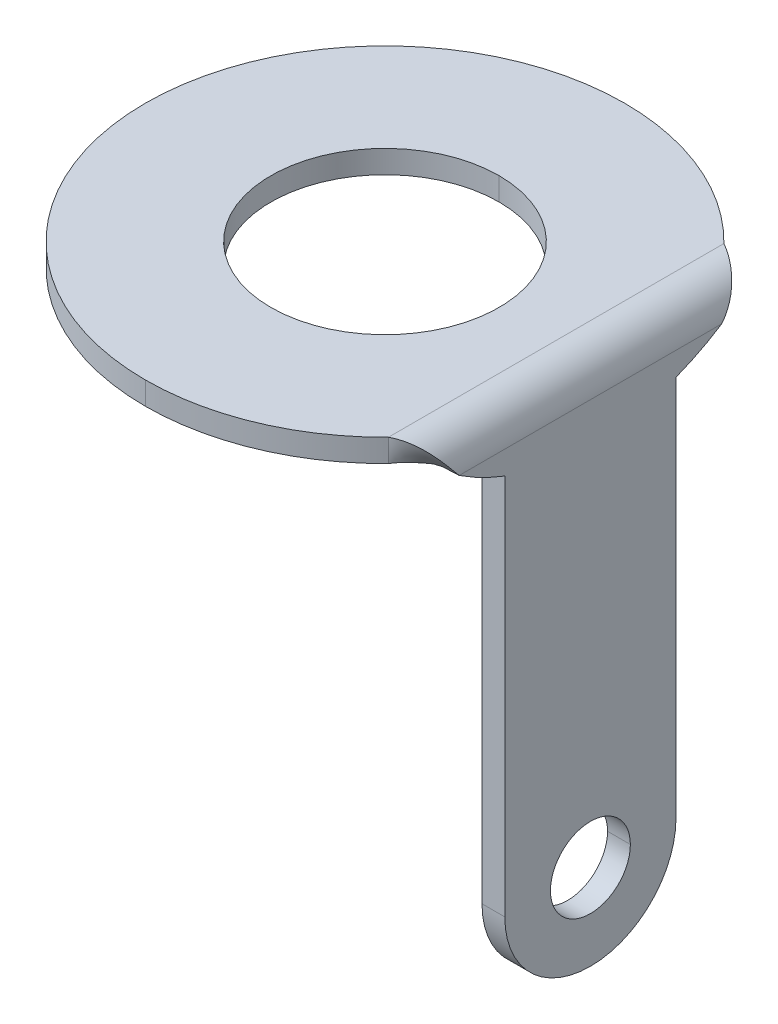
ISO-10303-21;
HEADER;
FILE_DESCRIPTION(('STEP AP214'),'2;1');
FILE_NAME('part.step','',(''),(''),'','','');
FILE_SCHEMA(('AUTOMOTIVE_DESIGN { 1 0 10303 214 1 1 1 1 }'));
ENDSEC;
DATA;
#1=APPLICATION_CONTEXT('core data for automotive mechanical design processes');
#2=APPLICATION_PROTOCOL_DEFINITION('international standard','automotive_design',2000,#1);
#3=PRODUCT_CONTEXT('',#1,'mechanical');
#4=PRODUCT('Part','Part','',(#3));
#5=PRODUCT_RELATED_PRODUCT_CATEGORY('part','',(#4));
#6=PRODUCT_DEFINITION_FORMATION('','',#4);
#7=PRODUCT_DEFINITION_CONTEXT('part definition',#1,'design');
#8=PRODUCT_DEFINITION('design','',#6,#7);
#9=PRODUCT_DEFINITION_SHAPE('','',#8);
#10=(LENGTH_UNIT() NAMED_UNIT(*) SI_UNIT(.MILLI.,.METRE.));
#11=(NAMED_UNIT(*) PLANE_ANGLE_UNIT() SI_UNIT($,.RADIAN.));
#12=(NAMED_UNIT(*) SI_UNIT($,.STERADIAN.) SOLID_ANGLE_UNIT());
#13=UNCERTAINTY_MEASURE_WITH_UNIT(LENGTH_MEASURE(1.E-05),#10,'distance_accuracy_value','');
#14=(GEOMETRIC_REPRESENTATION_CONTEXT(3) GLOBAL_UNCERTAINTY_ASSIGNED_CONTEXT((#13)) GLOBAL_UNIT_ASSIGNED_CONTEXT((#10,
#11,#12)) REPRESENTATION_CONTEXT('',''));
#15=CARTESIAN_POINT('',(0.,0.,0.));
#16=DIRECTION('',(0.,0.,1.));
#17=DIRECTION('',(1.,0.,0.));
#18=AXIS2_PLACEMENT_3D('',#15,#16,#17);
#19=CARTESIAN_POINT('',(-0.4,-9.2,5.));
#20=DIRECTION('',(1.,0.,0.));
#21=DIRECTION('',(0.,1.,0.));
#22=AXIS2_PLACEMENT_3D('',#19,#20,#21);
#23=PLANE('',#22);
#24=CARTESIAN_POINT('',(-0.4,-7.7,0.));
#25=DIRECTION('',(1.,0.,0.));
#26=DIRECTION('',(0.,0.,1.));
#27=AXIS2_PLACEMENT_3D('',#24,#25,#26);
#28=CIRCLE('',#27,0.7);
#29=CARTESIAN_POINT('',(-0.4,-7.7,0.7));
#30=VERTEX_POINT('',#29);
#31=CARTESIAN_POINT('',(-0.4,-7.7,-0.7));
#32=VERTEX_POINT('',#31);
#33=EDGE_CURVE('E418',#30,#32,#28,.T.);
#34=ORIENTED_EDGE('',*,*,#33,.T.);
#35=CARTESIAN_POINT('',(-0.4,-7.7,0.));
#36=DIRECTION('',(1.,0.,0.));
#37=DIRECTION('',(0.,0.,1.));
#38=AXIS2_PLACEMENT_3D('',#35,#36,#37);
#39=CIRCLE('',#38,0.7);
#40=EDGE_CURVE('E400',#32,#30,#39,.T.);
#41=ORIENTED_EDGE('',*,*,#40,.T.);
#42=EDGE_LOOP('',(#34,#41));
#43=FACE_BOUND('',#42,.T.);
#44=CARTESIAN_POINT('',(-0.4,-7.7,0.));
#45=DIRECTION('',(1.,0.,0.));
#46=DIRECTION('',(0.,0.,1.));
#47=AXIS2_PLACEMENT_3D('',#44,#45,#46);
#48=CIRCLE('',#47,1.5);
#49=CARTESIAN_POINT('',(-0.4,-7.7,1.5));
#50=VERTEX_POINT('',#49);
#51=CARTESIAN_POINT('',(-0.4,-7.7,-1.5));
#52=VERTEX_POINT('',#51);
#53=EDGE_CURVE('E408',#50,#52,#48,.T.);
#54=ORIENTED_EDGE('',*,*,#53,.F.);
#55=DIRECTION('',(0.,-1.,0.));
#56=VECTOR('',#55,1.);
#57=CARTESIAN_POINT('',(-0.4,-4.354424891914,1.5));
#58=LINE('',#57,#56);
#59=CARTESIAN_POINT('',(-0.4,-1.00884978382783,1.5));
#60=VERTEX_POINT('',#59);
#61=EDGE_CURVE('E28',#60,#50,#58,.T.);
#62=ORIENTED_EDGE('',*,*,#61,.F.);
#63=CARTESIAN_POINT('',(-0.4,2.914159265359,1.412203687323E-13));
#64=DIRECTION('',(1.,0.,0.));
#65=DIRECTION('',(0.,0.,1.));
#66=AXIS2_PLACEMENT_3D('',#63,#64,#65);
#67=CIRCLE('',#66,4.2);
#68=CARTESIAN_POINT('',(-0.4,-0.599999999999978,2.30014883381305));
#69=VERTEX_POINT('',#68);
#70=EDGE_CURVE('E11',#69,#60,#67,.T.);
#71=ORIENTED_EDGE('',*,*,#70,.F.);
#72=DIRECTION('',(0.,0.,-1.));
#73=VECTOR('',#72,1.);
#74=CARTESIAN_POINT('',(-0.4,-0.6,5.));
#75=LINE('',#74,#73);
#76=CARTESIAN_POINT('',(-0.4,-0.599999999999952,-2.30014883381284));
#77=VERTEX_POINT('',#76);
#78=EDGE_CURVE('E365',#69,#77,#75,.T.);
#79=ORIENTED_EDGE('',*,*,#78,.T.);
#80=CARTESIAN_POINT('',(-0.4,2.914159265359,-1.465494392505E-13));
#81=DIRECTION('',(1.,0.,0.));
#82=DIRECTION('',(0.,0.,1.));
#83=AXIS2_PLACEMENT_3D('',#80,#81,#82);
#84=CIRCLE('',#83,4.2);
#85=CARTESIAN_POINT('',(-0.4,-1.00884978382768,-1.49999999999994));
#86=VERTEX_POINT('',#85);
#87=EDGE_CURVE('E323',#86,#77,#84,.T.);
#88=ORIENTED_EDGE('',*,*,#87,.F.);
#89=DIRECTION('',(0.,1.,0.));
#90=VECTOR('',#89,1.);
#91=CARTESIAN_POINT('',(-0.4,-4.354424891914,-1.5));
#92=LINE('',#91,#90);
#93=EDGE_CURVE('E180',#52,#86,#92,.T.);
#94=ORIENTED_EDGE('',*,*,#93,.F.);
#95=EDGE_LOOP('',(#54,#62,#71,#79,#88,#94));
#96=FACE_BOUND('',#95,.T.);
#97=ADVANCED_FACE('F17',(#43,#96),#23,.F.);
#98=CARTESIAN_POINT('',(-0.2,2.914159265359,1.412203687323E-13));
#99=DIRECTION('',(-1.,0.,0.));
#100=DIRECTION('',(0.,0.,1.));
#101=AXIS2_PLACEMENT_3D('',#98,#99,#100);
#102=CYLINDRICAL_SURFACE('',#101,4.2);
#103=DIRECTION('',(-1.,0.,0.));
#104=VECTOR('',#103,1.);
#105=CARTESIAN_POINT('',(-0.2,-1.008849783828,1.5));
#106=LINE('',#105,#104);
#107=CARTESIAN_POINT('',(0.,-1.00884978382783,1.5));
#108=VERTEX_POINT('',#107);
#109=EDGE_CURVE('E405',#108,#60,#106,.T.);
#110=ORIENTED_EDGE('',*,*,#109,.F.);
#111=CARTESIAN_POINT('',(0.,2.914159265359,1.412203687323E-13));
#112=DIRECTION('',(1.,0.,0.));
#113=DIRECTION('',(0.,0.,1.));
#114=AXIS2_PLACEMENT_3D('',#111,#112,#113);
#115=CIRCLE('',#114,4.2);
#116=CARTESIAN_POINT('',(0.,-0.600000000000009,2.30014883381305));
#117=VERTEX_POINT('',#116);
#118=EDGE_CURVE('E245',#117,#108,#115,.T.);
#119=ORIENTED_EDGE('',*,*,#118,.F.);
#120=DIRECTION('',(1.,-1.56792025836786E-13,0.));
#121=VECTOR('',#120,1.);
#122=CARTESIAN_POINT('',(-0.199961399023881,-0.599999999999987,2.30014883381292));
#123=LINE('',#122,#121);
#124=EDGE_CURVE('E372',#69,#117,#123,.T.);
#125=ORIENTED_EDGE('',*,*,#124,.F.);
#126=ORIENTED_EDGE('',*,*,#70,.T.);
#127=EDGE_LOOP('',(#110,#119,#125,#126));
#128=FACE_BOUND('',#127,.T.);
#129=ADVANCED_FACE('F584',(#128),#102,.T.);
#130=CARTESIAN_POINT('',(-0.2,-4.354424891914,1.5));
#131=DIRECTION('',(0.,0.,1.));
#132=DIRECTION('',(1.,0.,0.));
#133=AXIS2_PLACEMENT_3D('',#130,#131,#132);
#134=PLANE('',#133);
#135=DIRECTION('',(-1.,0.,0.));
#136=VECTOR('',#135,1.);
#137=CARTESIAN_POINT('',(-0.2,-7.7,1.5));
#138=LINE('',#137,#136);
#139=CARTESIAN_POINT('',(0.,-7.7,1.5));
#140=VERTEX_POINT('',#139);
#141=EDGE_CURVE('E183',#140,#50,#138,.T.);
#142=ORIENTED_EDGE('',*,*,#141,.F.);
#143=DIRECTION('',(0.,-1.,0.));
#144=VECTOR('',#143,1.);
#145=CARTESIAN_POINT('',(0.,-9.2,1.5));
#146=LINE('',#145,#144);
#147=EDGE_CURVE('E249',#108,#140,#146,.T.);
#148=ORIENTED_EDGE('',*,*,#147,.F.);
#149=ORIENTED_EDGE('',*,*,#109,.T.);
#150=ORIENTED_EDGE('',*,*,#61,.T.);
#151=EDGE_LOOP('',(#142,#148,#149,#150));
#152=FACE_BOUND('',#151,.T.);
#153=ADVANCED_FACE('F444',(#152),#134,.T.);
#154=CARTESIAN_POINT('',(-0.2,-7.7,0.));
#155=DIRECTION('',(-1.,0.,0.));
#156=DIRECTION('',(0.,0.,1.));
#157=AXIS2_PLACEMENT_3D('',#154,#155,#156);
#158=CYLINDRICAL_SURFACE('',#157,1.5);
#159=DIRECTION('',(-1.,0.,0.));
#160=VECTOR('',#159,1.);
#161=CARTESIAN_POINT('',(-0.2,-7.7,-1.5));
#162=LINE('',#161,#160);
#163=CARTESIAN_POINT('',(0.,-7.7,-1.5));
#164=VERTEX_POINT('',#163);
#165=EDGE_CURVE('E184',#164,#52,#162,.T.);
#166=ORIENTED_EDGE('',*,*,#165,.F.);
#167=CARTESIAN_POINT('',(0.,-7.7,0.));
#168=DIRECTION('',(1.,0.,0.));
#169=DIRECTION('',(0.,0.,1.));
#170=AXIS2_PLACEMENT_3D('',#167,#168,#169);
#171=CIRCLE('',#170,1.5);
#172=EDGE_CURVE('E422',#140,#164,#171,.T.);
#173=ORIENTED_EDGE('',*,*,#172,.F.);
#174=ORIENTED_EDGE('',*,*,#141,.T.);
#175=ORIENTED_EDGE('',*,*,#53,.T.);
#176=EDGE_LOOP('',(#166,#173,#174,#175));
#177=FACE_BOUND('',#176,.T.);
#178=ADVANCED_FACE('F450',(#177),#158,.T.);
#179=CARTESIAN_POINT('',(-0.2,-4.354424891914,-1.5));
#180=DIRECTION('',(0.,0.,-1.));
#181=DIRECTION('',(0.,-1.,0.));
#182=AXIS2_PLACEMENT_3D('',#179,#180,#181);
#183=PLANE('',#182);
#184=DIRECTION('',(-1.,0.,0.));
#185=VECTOR('',#184,1.);
#186=CARTESIAN_POINT('',(-0.2,-1.00884978382771,-1.49999999999989));
#187=LINE('',#186,#185);
#188=CARTESIAN_POINT('',(0.,-1.00884978382768,-1.49999999999994));
#189=VERTEX_POINT('',#188);
#190=EDGE_CURVE('E369',#189,#86,#187,.T.);
#191=ORIENTED_EDGE('',*,*,#190,.F.);
#192=DIRECTION('',(0.,1.,0.));
#193=VECTOR('',#192,1.);
#194=CARTESIAN_POINT('',(0.,-9.2,-1.5));
#195=LINE('',#194,#193);
#196=EDGE_CURVE('E398',#164,#189,#195,.T.);
#197=ORIENTED_EDGE('',*,*,#196,.F.);
#198=ORIENTED_EDGE('',*,*,#165,.T.);
#199=ORIENTED_EDGE('',*,*,#93,.T.);
#200=EDGE_LOOP('',(#191,#197,#198,#199));
#201=FACE_BOUND('',#200,.T.);
#202=ADVANCED_FACE('F574',(#201),#183,.T.);
#203=CARTESIAN_POINT('',(-0.2,-7.7,0.));
#204=DIRECTION('',(-1.,0.,0.));
#205=DIRECTION('',(0.,0.,1.));
#206=AXIS2_PLACEMENT_3D('',#203,#204,#205);
#207=CYLINDRICAL_SURFACE('',#206,0.7);
#208=DIRECTION('',(-1.,0.,0.));
#209=VECTOR('',#208,1.);
#210=CARTESIAN_POINT('',(-0.2,-7.7,-0.7));
#211=LINE('',#210,#209);
#212=CARTESIAN_POINT('',(0.,-7.7,-0.7));
#213=VERTEX_POINT('',#212);
#214=EDGE_CURVE('E412',#213,#32,#211,.T.);
#215=ORIENTED_EDGE('',*,*,#214,.F.);
#216=CARTESIAN_POINT('',(0.,-7.7,0.));
#217=DIRECTION('',(-1.,0.,0.));
#218=DIRECTION('',(0.,0.,1.));
#219=AXIS2_PLACEMENT_3D('',#216,#217,#218);
#220=CIRCLE('',#219,0.7);
#221=CARTESIAN_POINT('',(0.,-7.7,0.7));
#222=VERTEX_POINT('',#221);
#223=EDGE_CURVE('E166',#222,#213,#220,.T.);
#224=ORIENTED_EDGE('',*,*,#223,.F.);
#225=DIRECTION('',(-1.,0.,0.));
#226=VECTOR('',#225,1.);
#227=CARTESIAN_POINT('',(-0.2,-7.7,0.7));
#228=LINE('',#227,#226);
#229=EDGE_CURVE('E235',#222,#30,#228,.T.);
#230=ORIENTED_EDGE('',*,*,#229,.T.);
#231=ORIENTED_EDGE('',*,*,#40,.F.);
#232=EDGE_LOOP('',(#215,#224,#230,#231));
#233=FACE_BOUND('',#232,.T.);
#234=ADVANCED_FACE('F578',(#233),#207,.F.);
#235=CARTESIAN_POINT('',(-0.2,2.914159265359,-1.465494392505E-13));
#236=DIRECTION('',(-1.,0.,0.));
#237=DIRECTION('',(0.,0.,1.));
#238=AXIS2_PLACEMENT_3D('',#235,#236,#237);
#239=CYLINDRICAL_SURFACE('',#238,4.2);
#240=DIRECTION('',(-1.,-2.94623155525761E-13,0.));
#241=VECTOR('',#240,1.);
#242=CARTESIAN_POINT('',(-0.199961399023923,-0.599999999999845,-2.3001488338125));
#243=LINE('',#242,#241);
#244=CARTESIAN_POINT('',(0.,-0.599999999999893,-2.30014883381284));
#245=VERTEX_POINT('',#244);
#246=EDGE_CURVE('E348',#245,#77,#243,.T.);
#247=ORIENTED_EDGE('',*,*,#246,.F.);
#248=CARTESIAN_POINT('',(0.,2.914159265359,-1.465494392505E-13));
#249=DIRECTION('',(1.,0.,0.));
#250=DIRECTION('',(0.,0.,1.));
#251=AXIS2_PLACEMENT_3D('',#248,#249,#250);
#252=CIRCLE('',#251,4.2);
#253=EDGE_CURVE('E250',#189,#245,#252,.T.);
#254=ORIENTED_EDGE('',*,*,#253,.F.);
#255=ORIENTED_EDGE('',*,*,#190,.T.);
#256=ORIENTED_EDGE('',*,*,#87,.T.);
#257=EDGE_LOOP('',(#247,#254,#255,#256));
#258=FACE_BOUND('',#257,.T.);
#259=ADVANCED_FACE('F333',(#258),#239,.T.);
#260=CARTESIAN_POINT('',(-0.6,-0.6,5.));
#261=DIRECTION('',(0.,0.,1.));
#262=DIRECTION('',(1.,0.,0.));
#263=AXIS2_PLACEMENT_3D('',#260,#261,#262);
#264=CYLINDRICAL_SURFACE('',#263,0.2);
#265=CARTESIAN_POINT('',(-0.605590475356138,-0.400079382313339,2.94869621659));
#266=CARTESIAN_POINT('',(-0.603724110918284,-0.400026330773651,2.945598116979));
#267=CARTESIAN_POINT('',(-0.572528574579034,-0.399585592102016,2.893660994816));
#268=CARTESIAN_POINT('',(-0.51378413205663,-0.413044349412892,2.790317247872));
#269=CARTESIAN_POINT('',(-0.447538614646796,-0.462621701692243,2.633401409728));
#270=CARTESIAN_POINT('',(-0.40796176854271,-0.52945023933194,2.470187557845));
#271=CARTESIAN_POINT('',(-0.399742717392321,-0.57862683406739,2.353796463909));
#272=CARTESIAN_POINT('',(-0.400016628049382,-0.602957869380745,2.292739618266));
#273=CARTESIAN_POINT('',(-0.400049715475822,-0.604430674436012,2.289029281986));
#274=(BOUNDED_CURVE() B_SPLINE_CURVE(3,(#265,#266,#267,#268,#269,#270,#271,#272,#273),
.UNSPECIFIED.,.F.,.F.) B_SPLINE_CURVE_WITH_KNOTS((4,1,1,1,1,1,4),(-0.01615737799204,
-0.000272802806039807,0.24972719719396,0.49972719719396,0.74972719719396,0.99972719719396,
1.015884575186),
.UNSPECIFIED.) CURVE() GEOMETRIC_REPRESENTATION_ITEM() RATIONAL_B_SPLINE_CURVE((1.,1.,1.,1.,1.,
1.,1.,1.,1.)) REPRESENTATION_ITEM(''));
#275=CARTESIAN_POINT('',(-0.600000000000134,-0.4,2.93938769133982));
#276=VERTEX_POINT('',#275);
#277=EDGE_CURVE('E190',#276,#69,#274,.T.);
#278=ORIENTED_EDGE('',*,*,#277,.F.);
#279=DIRECTION('',(0.,0.,-1.));
#280=VECTOR('',#279,1.);
#281=CARTESIAN_POINT('',(-0.6,-0.4,5.));
#282=LINE('',#281,#280);
#283=CARTESIAN_POINT('',(-0.6,-0.4,-2.93938769133991));
#284=VERTEX_POINT('',#283);
#285=EDGE_CURVE('E340',#276,#284,#282,.T.);
#286=ORIENTED_EDGE('',*,*,#285,.T.);
#287=CARTESIAN_POINT('',(-0.400049822774197,-0.604435447981233,-2.289017256271));
#288=CARTESIAN_POINT('',(-0.400016663997948,-0.60296106090554,-2.292731609366));
#289=CARTESIAN_POINT('',(-0.399742439429786,-0.578628497185309,-2.353792527643));
#290=CARTESIAN_POINT('',(-0.407961768542792,-0.529450239331833,-2.470187557845));
#291=CARTESIAN_POINT('',(-0.447538614646783,-0.46262170169213,-2.633401409727));
#292=CARTESIAN_POINT('',(-0.513784132056737,-0.413044349412789,-2.790317247872));
#293=CARTESIAN_POINT('',(-0.572525016895691,-0.399586407191761,-2.893654736108));
#294=CARTESIAN_POINT('',(-0.603716779607954,-0.400026227296697,-2.945585911118));
#295=CARTESIAN_POINT('',(-0.605579462653133,-0.400079069585649,-2.948677935782));
#296=(BOUNDED_CURVE() B_SPLINE_CURVE(3,(#287,#288,#289,#290,#291,#292,#293,#294,#295),
.UNSPECIFIED.,.F.,.F.) B_SPLINE_CURVE_WITH_KNOTS((4,1,1,1,1,1,4),(-0.0158533321630301,
0.000321501909970046,0.25032150190997,0.50032150190997,0.75032150190997,1.00032150190997,
1.016174834073),
.UNSPECIFIED.) CURVE() GEOMETRIC_REPRESENTATION_ITEM() RATIONAL_B_SPLINE_CURVE((1.,1.,1.,1.,1.,
1.,1.,1.,1.)) REPRESENTATION_ITEM(''));
#297=EDGE_CURVE('E318',#77,#284,#296,.T.);
#298=ORIENTED_EDGE('',*,*,#297,.F.);
#299=ORIENTED_EDGE('',*,*,#78,.F.);
#300=EDGE_LOOP('',(#278,#286,#298,#299));
#301=FACE_BOUND('',#300,.T.);
#302=ADVANCED_FACE('F209',(#301),#264,.F.);
#303=CARTESIAN_POINT('',(0.02288945550171,-0.6138025329323,2.289029281986));
#304=CARTESIAN_POINT('',(-0.1257440745466,-0.61050898032,2.289029281986));
#305=CARTESIAN_POINT('',(-0.274377604595,-0.6072154277077,2.289029281986));
#306=CARTESIAN_POINT('',(-0.4230111346434,-0.6039218750954,2.289029281986));
#307=CARTESIAN_POINT('',(0.02299253016889,-0.6092144187361,2.292739618266));
#308=CARTESIAN_POINT('',(-0.1256655954983,-0.6070156793418,2.292739618266));
#309=CARTESIAN_POINT('',(-0.2743237211655,-0.6048169399475,2.292739618266));
#310=CARTESIAN_POINT('',(-0.4229818468328,-0.6026182005533,2.292739618266));
#311=CARTESIAN_POINT('',(0.02384582257815,-0.5334178507332,2.353796463909));
#312=CARTESIAN_POINT('',(-0.1250159152418,-0.549305645584,2.353796463909));
#313=CARTESIAN_POINT('',(-0.2738776530618,-0.5651934404348,2.353796463909));
#314=CARTESIAN_POINT('',(-0.4227393908817,-0.5810812352856,2.353796463909));
#315=CARTESIAN_POINT('',(-0.001758343517437,-0.380221858084,2.470187557845));
#316=CARTESIAN_POINT('',(-0.1445104296855,-0.4326651941718,2.470187557845));
#317=CARTESIAN_POINT('',(-0.2872625158536,-0.4851085302597,2.470187557845));
#318=CARTESIAN_POINT('',(-0.4300146020217,-0.5375518663475,2.470187557845));
#319=CARTESIAN_POINT('',(-0.1250489913847,-0.1720361507146,2.633401409728));
#320=CARTESIAN_POINT('',(-0.2383815327963,-0.2741566427065,2.633401409728));
#321=CARTESIAN_POINT('',(-0.351714074208,-0.3762771346983,2.633401409728));
#322=CARTESIAN_POINT('',(-0.4650466156196,-0.4783976266902,2.633401409728));
#323=CARTESIAN_POINT('',(-0.3314184615108,-0.01759170948777,2.790317247872));
#324=CARTESIAN_POINT('',(-0.3955072365236,-0.1565656468111,2.790317247872));
#325=CARTESIAN_POINT('',(-0.4595960115363,-0.2955395841344,2.790317247872));
#326=CARTESIAN_POINT('',(-0.5236847865491,-0.4345135214578,2.790317247872));
#327=CARTESIAN_POINT('',(-0.5144204207408,0.02433530268457,2.893660994816));
#328=CARTESIAN_POINT('',(-0.5348413716062,-0.1246432346019,2.893660994816));
#329=CARTESIAN_POINT('',(-0.5552623224715,-0.2736217718884,2.893660994816));
#330=CARTESIAN_POINT('',(-0.5756832733369,-0.4226003091749,2.893660994816));
#331=CARTESIAN_POINT('',(-0.611601430964,0.02296230403213,2.945598116979));
#332=CARTESIAN_POINT('',(-0.6088331040601,-0.1256886090914,2.945598116979));
#333=CARTESIAN_POINT('',(-0.6060647771563,-0.2743395222149,2.945598116979));
#334=CARTESIAN_POINT('',(-0.6032964502524,-0.4229904353385,2.945598116979));
#335=CARTESIAN_POINT('',(-0.6174155698696,0.02279703672718,2.94869621659));
#336=CARTESIAN_POINT('',(-0.613259876424,-0.1258144404054,2.94869621659));
#337=CARTESIAN_POINT('',(-0.6091041829785,-0.274425917538,2.94869621659));
#338=CARTESIAN_POINT('',(-0.604948489533,-0.4230373946706,2.94869621659));
#339=(BOUNDED_SURFACE() B_SPLINE_SURFACE(3,3,((#303,#304,#305,#306),(#307,#308,#309,#310),(#311,
#312,#313,#314),(#315,#316,#317,#318),(#319,#320,#321,#322),(#323,#324,#325,#326),(#327,#328,
#329,#330),(#331,#332,#333,#334),(#335,#336,#337,#338)),.UNSPECIFIED.,.F.,.F.,
.F.) B_SPLINE_SURFACE_WITH_KNOTS((4,1,1,1,1,1,4),(4,4),(-0.01615737799204,0.,0.25,0.5,0.75,1.,
1.015884575186),(-0.05761082557077,1.05741782069),
.UNSPECIFIED.) GEOMETRIC_REPRESENTATION_ITEM() RATIONAL_B_SPLINE_SURFACE(((1.,1.,1.,1.),(1.,1.,
1.,1.),(1.,1.,1.,1.),(1.,1.,1.,1.),(1.,1.,1.,1.),(1.,1.,1.,1.),(1.,1.,1.,1.),(1.,1.,1.,1.),(1.,
1.,1.,1.))) REPRESENTATION_ITEM('') SURFACE());
#340=CARTESIAN_POINT('',(-0.000149146427385475,-0.613292023308108,2.289029281986));
#341=CARTESIAN_POINT('',(-4.98841481121614E-05,-0.608873608142187,2.292739618266));
#342=CARTESIAN_POINT('',(0.000771847822975634,-0.535880502202083,2.353796463909));
#343=CARTESIAN_POINT('',(-0.0238853056282402,-0.388350717995811,2.470187557845));
#344=CARTESIAN_POINT('',(-0.142615843940419,-0.187865105076647,2.633401409728));
#345=CARTESIAN_POINT('',(-0.341352396169845,-0.0391330482386593,2.790317247872));
#346=CARTESIAN_POINT('',(-0.517585723737025,0.00124322369400682,2.893660994816));
#347=CARTESIAN_POINT('',(-0.611172332754951,-7.8992320962728E-05,2.945598116979));
#348=CARTESIAN_POINT('',(-0.616771426068391,-0.000238146939920378,2.94869621659));
#349=(BOUNDED_CURVE() B_SPLINE_CURVE(3,(#340,#341,#342,#343,#344,#345,#346,#347,#348),
.UNSPECIFIED.,.F.,.F.) B_SPLINE_CURVE_WITH_KNOTS((4,1,1,1,1,1,4),(-0.01615737799204,0.,0.25,0.5,
0.75,1.,1.015884575186),
.UNSPECIFIED.) CURVE() GEOMETRIC_REPRESENTATION_ITEM() RATIONAL_B_SPLINE_CURVE((1.,1.,1.,1.,1.,
1.,1.,1.,1.)) REPRESENTATION_ITEM(''));
#350=CARTESIAN_POINT('',(-0.600000000000173,0.,2.93938769133971));
#351=VERTEX_POINT('',#350);
#352=EDGE_CURVE('E349',#351,#117,#349,.F.);
#353=DIRECTION('',(0.,1.,0.));
#354=VECTOR('',#353,1.);
#355=CARTESIAN_POINT('',(-0.600000000000093,-0.2,2.93938769133991));
#356=LINE('',#355,#354);
#357=EDGE_CURVE('E179',#276,#351,#356,.T.);
#358=ORIENTED_EDGE('',*,*,#124,.T.);
#359=ORIENTED_EDGE('',*,*,#352,.F.);
#360=ORIENTED_EDGE('',*,*,#357,.F.);
#361=ORIENTED_EDGE('',*,*,#277,.T.);
#362=EDGE_LOOP('',(#358,#359,#360,#361));
#363=FACE_BOUND('',#362,.T.);
#364=ADVANCED_FACE('F196',(#363),#339,.T.);
#365=CARTESIAN_POINT('',(0.,-9.2,5.));
#366=DIRECTION('',(1.,0.,0.));
#367=DIRECTION('',(0.,1.,0.));
#368=AXIS2_PLACEMENT_3D('',#365,#366,#367);
#369=PLANE('',#368);
#370=ORIENTED_EDGE('',*,*,#223,.T.);
#371=CARTESIAN_POINT('',(0.,-7.7,0.));
#372=DIRECTION('',(-1.,0.,0.));
#373=DIRECTION('',(0.,0.,1.));
#374=AXIS2_PLACEMENT_3D('',#371,#372,#373);
#375=CIRCLE('',#374,0.7);
#376=EDGE_CURVE('E174',#213,#222,#375,.T.);
#377=ORIENTED_EDGE('',*,*,#376,.T.);
#378=EDGE_LOOP('',(#370,#377));
#379=FACE_BOUND('',#378,.T.);
#380=ORIENTED_EDGE('',*,*,#172,.T.);
#381=ORIENTED_EDGE('',*,*,#196,.T.);
#382=ORIENTED_EDGE('',*,*,#253,.T.);
#383=DIRECTION('',(0.,0.,-1.));
#384=VECTOR('',#383,1.);
#385=CARTESIAN_POINT('',(0.,-0.6,5.));
#386=LINE('',#385,#384);
#387=EDGE_CURVE('E253',#117,#245,#386,.T.);
#388=ORIENTED_EDGE('',*,*,#387,.F.);
#389=ORIENTED_EDGE('',*,*,#118,.T.);
#390=ORIENTED_EDGE('',*,*,#147,.T.);
#391=EDGE_LOOP('',(#380,#381,#382,#388,#389,#390));
#392=FACE_BOUND('',#391,.T.);
#393=ADVANCED_FACE('F208',(#379,#392),#369,.T.);
#394=CARTESIAN_POINT('',(-0.6173812628588,0.02279801094301,-2.948677935782));
#395=CARTESIAN_POINT('',(-0.6132337557328,-0.1258136986564,-2.948677935782));
#396=CARTESIAN_POINT('',(-0.6090862486068,-0.2744254082558,-2.948677935782));
#397=CARTESIAN_POINT('',(-0.6049387414808,-0.4230371178552,-2.948677935782));
#398=CARTESIAN_POINT('',(-0.6115785923072,0.02296262638584,-2.945585911118));
#399=CARTESIAN_POINT('',(-0.6088157151507,-0.1256883636576,-2.945585911118));
#400=CARTESIAN_POINT('',(-0.6060528379943,-0.274339353701,-2.945585911118));
#401=CARTESIAN_POINT('',(-0.6032899608378,-0.4229903437444,-2.945585911118));
#402=CARTESIAN_POINT('',(-0.5144093377686,0.0243327634991,-2.893654736108));
#403=CARTESIAN_POINT('',(-0.5348329332465,-0.1246451678884,-2.893654736108));
#404=CARTESIAN_POINT('',(-0.5552565287245,-0.2736230992758,-2.893654736108));
#405=CARTESIAN_POINT('',(-0.5756801242024,-0.4226010306633,-2.893654736108));
#406=CARTESIAN_POINT('',(-0.3314184615111,-0.01759170948768,-2.790317247872));
#407=CARTESIAN_POINT('',(-0.3955072365238,-0.156565646811,-2.790317247872));
#408=CARTESIAN_POINT('',(-0.4595960115365,-0.2955395841344,-2.790317247872));
#409=CARTESIAN_POINT('',(-0.5236847865492,-0.4345135214577,-2.790317247872));
#410=CARTESIAN_POINT('',(-0.1250489913848,-0.1720361507145,-2.633401409727));
#411=CARTESIAN_POINT('',(-0.2383815327964,-0.2741566427063,-2.633401409727));
#412=CARTESIAN_POINT('',(-0.351714074208,-0.3762771346982,-2.633401409727));
#413=CARTESIAN_POINT('',(-0.4650466156196,-0.4783976266901,-2.633401409727));
#414=CARTESIAN_POINT('',(-0.001758343517547,-0.3802218580838,-2.470187557845));
#415=CARTESIAN_POINT('',(-0.1445104296856,-0.4326651941717,-2.470187557845));
#416=CARTESIAN_POINT('',(-0.2872625158537,-0.4851085302596,-2.470187557845));
#417=CARTESIAN_POINT('',(-0.4300146020218,-0.5375518663474,-2.470187557845));
#418=CARTESIAN_POINT('',(0.02384668849309,-0.5334230317142,-2.353792527643));
#419=CARTESIAN_POINT('',(-0.125015255951,-0.5493095902823,-2.353792527643));
#420=CARTESIAN_POINT('',(-0.2738772003951,-0.5651961488503,-2.353792527643));
#421=CARTESIAN_POINT('',(-0.4227391448392,-0.5810827074183,-2.353792527643));
#422=CARTESIAN_POINT('',(0.02299241818109,-0.6092243610432,-2.292731609366));
#423=CARTESIAN_POINT('',(-0.1256656807637,-0.6070232492212,-2.292731609366));
#424=CARTESIAN_POINT('',(-0.2743237797084,-0.6048221373992,-2.292731609366));
#425=CARTESIAN_POINT('',(-0.4229818786532,-0.6026210255773,-2.292731609366));
#426=CARTESIAN_POINT('',(0.02288912124323,-0.6138174035836,-2.289017256271));
#427=CARTESIAN_POINT('',(-0.1257443290446,-0.6105203025449,-2.289017256271));
#428=CARTESIAN_POINT('',(-0.2743777793323,-0.6072232015062,-2.289017256271));
#429=CARTESIAN_POINT('',(-0.4230112296201,-0.6039261004675,-2.289017256271));
#430=(BOUNDED_SURFACE() B_SPLINE_SURFACE(3,3,((#394,#395,#396,#397),(#398,#399,#400,#401),(#402,
#403,#404,#405),(#406,#407,#408,#409),(#410,#411,#412,#413),(#414,#415,#416,#417),(#418,#419,
#420,#421),(#422,#423,#424,#425),(#426,#427,#428,#429)),.UNSPECIFIED.,.F.,.F.,
.F.) B_SPLINE_SURFACE_WITH_KNOTS((4,1,1,1,1,1,4),(4,4),(-0.01585333216303,0.,0.25,0.5,0.75,1.,
1.016174834073),(-0.05761082557072,1.05741782069),
.UNSPECIFIED.) GEOMETRIC_REPRESENTATION_ITEM() RATIONAL_B_SPLINE_SURFACE(((1.,1.,1.,1.),(1.,1.,
1.,1.),(1.,1.,1.,1.),(1.,1.,1.,1.),(1.,1.,1.,1.),(1.,1.,1.,1.),(1.,1.,1.,1.),(1.,1.,1.,1.),(1.,
1.,1.,1.))) REPRESENTATION_ITEM('') SURFACE());
#431=DIRECTION('',(0.,-1.,0.));
#432=VECTOR('',#431,1.);
#433=CARTESIAN_POINT('',(-0.600000000000093,-0.2,-2.93938769133991));
#434=LINE('',#433,#432);
#435=CARTESIAN_POINT('',(-0.600000000000093,0.,-2.93938769133981));
#436=VERTEX_POINT('',#435);
#437=EDGE_CURVE('E168',#436,#284,#434,.T.);
#438=CARTESIAN_POINT('',(-0.616738387959423,-0.000237208757054326,-2.948677935782));
#439=CARTESIAN_POINT('',(-0.611150338823839,-7.86818900206193E-05,-2.945585911118));
#440=CARTESIAN_POINT('',(-0.517575050686963,0.00124077842455583,-2.893654736108));
#441=CARTESIAN_POINT('',(-0.341352396170118,-0.0391330482385429,-2.790317247872));
#442=CARTESIAN_POINT('',(-0.142615843940497,-0.187865105076514,-2.633401409727));
#443=CARTESIAN_POINT('',(-0.0238853056283223,-0.388350717995616,-2.470187557845));
#444=CARTESIAN_POINT('',(0.000772681710639122,-0.535885491555894,-2.353792527643));
#445=CARTESIAN_POINT('',(-4.99919938390535E-05,-0.608883182716534,-2.292731609366));
#446=CARTESIAN_POINT('',(-0.000149468322744604,-0.613306343943653,-2.289017256271));
#447=(BOUNDED_CURVE() B_SPLINE_CURVE(3,(#438,#439,#440,#441,#442,#443,#444,#445,#446),
.UNSPECIFIED.,.F.,.F.) B_SPLINE_CURVE_WITH_KNOTS((4,1,1,1,1,1,4),(-0.01585333216303,0.,0.25,0.5,
0.75,1.,1.016174834073),
.UNSPECIFIED.) CURVE() GEOMETRIC_REPRESENTATION_ITEM() RATIONAL_B_SPLINE_CURVE((1.,1.,1.,1.,1.,
1.,1.,1.,1.)) REPRESENTATION_ITEM(''));
#448=EDGE_CURVE('E257',#245,#436,#447,.F.);
#449=ORIENTED_EDGE('',*,*,#437,.F.);
#450=ORIENTED_EDGE('',*,*,#448,.F.);
#451=ORIENTED_EDGE('',*,*,#246,.T.);
#452=ORIENTED_EDGE('',*,*,#297,.T.);
#453=EDGE_LOOP('',(#449,#450,#451,#452));
#454=FACE_BOUND('',#453,.T.);
#455=ADVANCED_FACE('F282',(#454),#430,.T.);
#456=CARTESIAN_POINT('',(-0.6,-0.4,5.));
#457=DIRECTION('',(0.,1.,0.));
#458=DIRECTION('',(1.,0.,0.));
#459=AXIS2_PLACEMENT_3D('',#456,#457,#458);
#460=PLANE('',#459);
#461=CARTESIAN_POINT('',(-3.6,-0.4,0.));
#462=DIRECTION('',(0.,1.,0.));
#463=DIRECTION('',(0.,0.,-1.));
#464=AXIS2_PLACEMENT_3D('',#461,#462,#463);
#465=CIRCLE('',#464,2.);
#466=CARTESIAN_POINT('',(-3.6,-0.4,-2.));
#467=VERTEX_POINT('',#466);
#468=CARTESIAN_POINT('',(-3.6,-0.4,2.));
#469=VERTEX_POINT('',#468);
#470=EDGE_CURVE('E154',#467,#469,#465,.T.);
#471=ORIENTED_EDGE('',*,*,#470,.T.);
#472=CARTESIAN_POINT('',(-3.6,-0.4,0.));
#473=DIRECTION('',(0.,1.,0.));
#474=DIRECTION('',(0.,0.,-1.));
#475=AXIS2_PLACEMENT_3D('',#472,#473,#474);
#476=CIRCLE('',#475,2.);
#477=EDGE_CURVE('E144',#469,#467,#476,.T.);
#478=ORIENTED_EDGE('',*,*,#477,.T.);
#479=EDGE_LOOP('',(#471,#478));
#480=FACE_BOUND('',#479,.T.);
#481=ORIENTED_EDGE('',*,*,#285,.F.);
#482=CARTESIAN_POINT('',(-3.6,-0.4,0.));
#483=DIRECTION('',(0.,1.,0.));
#484=DIRECTION('',(0.,0.,-1.));
#485=AXIS2_PLACEMENT_3D('',#482,#483,#484);
#486=CIRCLE('',#485,4.2);
#487=CARTESIAN_POINT('',(-3.6,-0.4,4.2));
#488=VERTEX_POINT('',#487);
#489=EDGE_CURVE('E355',#488,#276,#486,.T.);
#490=ORIENTED_EDGE('',*,*,#489,.F.);
#491=CARTESIAN_POINT('',(-3.6,-0.4,0.));
#492=DIRECTION('',(0.,1.,0.));
#493=DIRECTION('',(0.,0.,-1.));
#494=AXIS2_PLACEMENT_3D('',#491,#492,#493);
#495=CIRCLE('',#494,4.2);
#496=CARTESIAN_POINT('',(-3.6,-0.4,-4.2));
#497=VERTEX_POINT('',#496);
#498=EDGE_CURVE('E170',#497,#488,#495,.T.);
#499=ORIENTED_EDGE('',*,*,#498,.F.);
#500=CARTESIAN_POINT('',(-3.6,-0.4,0.));
#501=DIRECTION('',(0.,1.,0.));
#502=DIRECTION('',(0.,0.,-1.));
#503=AXIS2_PLACEMENT_3D('',#500,#501,#502);
#504=CIRCLE('',#503,4.2);
#505=EDGE_CURVE('E258',#284,#497,#504,.T.);
#506=ORIENTED_EDGE('',*,*,#505,.F.);
#507=EDGE_LOOP('',(#481,#490,#499,#506));
#508=FACE_BOUND('',#507,.T.);
#509=ADVANCED_FACE('F19',(#480,#508),#460,.F.);
#510=CARTESIAN_POINT('',(-0.6,-0.6,5.));
#511=DIRECTION('',(0.,0.,1.));
#512=DIRECTION('',(1.,0.,0.));
#513=AXIS2_PLACEMENT_3D('',#510,#511,#512);
#514=CYLINDRICAL_SURFACE('',#513,0.6);
#515=ORIENTED_EDGE('',*,*,#387,.T.);
#516=ORIENTED_EDGE('',*,*,#448,.T.);
#517=DIRECTION('',(0.,0.,-1.));
#518=VECTOR('',#517,1.);
#519=CARTESIAN_POINT('',(-0.6,0.,5.));
#520=LINE('',#519,#518);
#521=EDGE_CURVE('E226',#351,#436,#520,.T.);
#522=ORIENTED_EDGE('',*,*,#521,.F.);
#523=ORIENTED_EDGE('',*,*,#352,.T.);
#524=EDGE_LOOP('',(#515,#516,#522,#523));
#525=FACE_BOUND('',#524,.T.);
#526=ADVANCED_FACE('F210',(#525),#514,.T.);
#527=CARTESIAN_POINT('',(-3.6,-0.2,0.));
#528=DIRECTION('',(0.,-1.,0.));
#529=DIRECTION('',(0.,0.,-1.));
#530=AXIS2_PLACEMENT_3D('',#527,#528,#529);
#531=CYLINDRICAL_SURFACE('',#530,4.2);
#532=DIRECTION('',(0.,-1.,0.));
#533=VECTOR('',#532,1.);
#534=CARTESIAN_POINT('',(-3.6,-0.2,-4.2));
#535=LINE('',#534,#533);
#536=CARTESIAN_POINT('',(-3.6,0.,-4.2));
#537=VERTEX_POINT('',#536);
#538=EDGE_CURVE('E175',#537,#497,#535,.T.);
#539=ORIENTED_EDGE('',*,*,#538,.F.);
#540=CARTESIAN_POINT('',(-3.6,0.,0.));
#541=DIRECTION('',(0.,1.,0.));
#542=DIRECTION('',(0.,0.,-1.));
#543=AXIS2_PLACEMENT_3D('',#540,#541,#542);
#544=CIRCLE('',#543,4.2);
#545=EDGE_CURVE('E145',#436,#537,#544,.T.);
#546=ORIENTED_EDGE('',*,*,#545,.F.);
#547=ORIENTED_EDGE('',*,*,#437,.T.);
#548=ORIENTED_EDGE('',*,*,#505,.T.);
#549=EDGE_LOOP('',(#539,#546,#547,#548));
#550=FACE_BOUND('',#549,.T.);
#551=ADVANCED_FACE('F334',(#550),#531,.T.);
#552=CARTESIAN_POINT('',(-3.6,-0.2,0.));
#553=DIRECTION('',(0.,-1.,0.));
#554=DIRECTION('',(0.,0.,-1.));
#555=AXIS2_PLACEMENT_3D('',#552,#553,#554);
#556=CYLINDRICAL_SURFACE('',#555,2.);
#557=DIRECTION('',(0.,-1.,0.));
#558=VECTOR('',#557,1.);
#559=CARTESIAN_POINT('',(-3.6,-0.2,2.));
#560=LINE('',#559,#558);
#561=CARTESIAN_POINT('',(-3.6,0.,2.));
#562=VERTEX_POINT('',#561);
#563=EDGE_CURVE('E148',#562,#469,#560,.T.);
#564=ORIENTED_EDGE('',*,*,#563,.F.);
#565=CARTESIAN_POINT('',(-3.6,0.,0.));
#566=DIRECTION('',(0.,-1.,0.));
#567=DIRECTION('',(0.,0.,-1.));
#568=AXIS2_PLACEMENT_3D('',#565,#566,#567);
#569=CIRCLE('',#568,2.);
#570=CARTESIAN_POINT('',(-3.6,0.,-2.));
#571=VERTEX_POINT('',#570);
#572=EDGE_CURVE('E134',#571,#562,#569,.T.);
#573=ORIENTED_EDGE('',*,*,#572,.F.);
#574=DIRECTION('',(0.,-1.,0.));
#575=VECTOR('',#574,1.);
#576=CARTESIAN_POINT('',(-3.6,-0.2,-2.));
#577=LINE('',#576,#575);
#578=EDGE_CURVE('E157',#571,#467,#577,.T.);
#579=ORIENTED_EDGE('',*,*,#578,.T.);
#580=ORIENTED_EDGE('',*,*,#477,.F.);
#581=EDGE_LOOP('',(#564,#573,#579,#580));
#582=FACE_BOUND('',#581,.T.);
#583=ADVANCED_FACE('F149',(#582),#556,.F.);
#584=CARTESIAN_POINT('',(-0.6,0.,5.));
#585=DIRECTION('',(0.,1.,0.));
#586=DIRECTION('',(1.,0.,0.));
#587=AXIS2_PLACEMENT_3D('',#584,#585,#586);
#588=PLANE('',#587);
#589=ORIENTED_EDGE('',*,*,#572,.T.);
#590=CARTESIAN_POINT('',(-3.6,0.,0.));
#591=DIRECTION('',(0.,-1.,0.));
#592=DIRECTION('',(0.,0.,-1.));
#593=AXIS2_PLACEMENT_3D('',#590,#591,#592);
#594=CIRCLE('',#593,2.);
#595=EDGE_CURVE('E139',#562,#571,#594,.T.);
#596=ORIENTED_EDGE('',*,*,#595,.T.);
#597=EDGE_LOOP('',(#589,#596));
#598=FACE_BOUND('',#597,.T.);
#599=ORIENTED_EDGE('',*,*,#521,.T.);
#600=ORIENTED_EDGE('',*,*,#545,.T.);
#601=CARTESIAN_POINT('',(-3.6,0.,0.));
#602=DIRECTION('',(0.,1.,0.));
#603=DIRECTION('',(0.,0.,-1.));
#604=AXIS2_PLACEMENT_3D('',#601,#602,#603);
#605=CIRCLE('',#604,4.2);
#606=CARTESIAN_POINT('',(-3.6,0.,4.2));
#607=VERTEX_POINT('',#606);
#608=EDGE_CURVE('E176',#537,#607,#605,.T.);
#609=ORIENTED_EDGE('',*,*,#608,.T.);
#610=CARTESIAN_POINT('',(-3.6,0.,0.));
#611=DIRECTION('',(0.,1.,0.));
#612=DIRECTION('',(0.,0.,-1.));
#613=AXIS2_PLACEMENT_3D('',#610,#611,#612);
#614=CIRCLE('',#613,4.2);
#615=EDGE_CURVE('E238',#607,#351,#614,.T.);
#616=ORIENTED_EDGE('',*,*,#615,.T.);
#617=EDGE_LOOP('',(#599,#600,#609,#616));
#618=FACE_BOUND('',#617,.T.);
#619=ADVANCED_FACE('F136',(#598,#618),#588,.T.);
#620=CARTESIAN_POINT('',(-0.2,-7.7,0.));
#621=DIRECTION('',(-1.,0.,0.));
#622=DIRECTION('',(0.,0.,1.));
#623=AXIS2_PLACEMENT_3D('',#620,#621,#622);
#624=CYLINDRICAL_SURFACE('',#623,0.7);
#625=ORIENTED_EDGE('',*,*,#376,.F.);
#626=ORIENTED_EDGE('',*,*,#214,.T.);
#627=ORIENTED_EDGE('',*,*,#33,.F.);
#628=ORIENTED_EDGE('',*,*,#229,.F.);
#629=EDGE_LOOP('',(#625,#626,#627,#628));
#630=FACE_BOUND('',#629,.T.);
#631=ADVANCED_FACE('F295',(#630),#624,.F.);
#632=CARTESIAN_POINT('',(-3.6,-0.2,0.));
#633=DIRECTION('',(0.,-1.,0.));
#634=DIRECTION('',(0.,0.,-1.));
#635=AXIS2_PLACEMENT_3D('',#632,#633,#634);
#636=CYLINDRICAL_SURFACE('',#635,4.2);
#637=DIRECTION('',(0.,-1.,0.));
#638=VECTOR('',#637,1.);
#639=CARTESIAN_POINT('',(-3.6,-0.2,4.2));
#640=LINE('',#639,#638);
#641=EDGE_CURVE('E242',#607,#488,#640,.T.);
#642=ORIENTED_EDGE('',*,*,#641,.F.);
#643=ORIENTED_EDGE('',*,*,#608,.F.);
#644=ORIENTED_EDGE('',*,*,#538,.T.);
#645=ORIENTED_EDGE('',*,*,#498,.T.);
#646=EDGE_LOOP('',(#642,#643,#644,#645));
#647=FACE_BOUND('',#646,.T.);
#648=ADVANCED_FACE('F293',(#647),#636,.T.);
#649=CARTESIAN_POINT('',(-3.6,-0.2,0.));
#650=DIRECTION('',(0.,-1.,0.));
#651=DIRECTION('',(0.,0.,-1.));
#652=AXIS2_PLACEMENT_3D('',#649,#650,#651);
#653=CYLINDRICAL_SURFACE('',#652,4.2);
#654=ORIENTED_EDGE('',*,*,#615,.F.);
#655=ORIENTED_EDGE('',*,*,#641,.T.);
#656=ORIENTED_EDGE('',*,*,#489,.T.);
#657=ORIENTED_EDGE('',*,*,#357,.T.);
#658=EDGE_LOOP('',(#654,#655,#656,#657));
#659=FACE_BOUND('',#658,.T.);
#660=ADVANCED_FACE('F559',(#659),#653,.T.);
#661=CARTESIAN_POINT('',(-3.6,-0.2,0.));
#662=DIRECTION('',(0.,-1.,0.));
#663=DIRECTION('',(0.,0.,-1.));
#664=AXIS2_PLACEMENT_3D('',#661,#662,#663);
#665=CYLINDRICAL_SURFACE('',#664,2.);
#666=ORIENTED_EDGE('',*,*,#595,.F.);
#667=ORIENTED_EDGE('',*,*,#563,.T.);
#668=ORIENTED_EDGE('',*,*,#470,.F.);
#669=ORIENTED_EDGE('',*,*,#578,.F.);
#670=EDGE_LOOP('',(#666,#667,#668,#669));
#671=FACE_BOUND('',#670,.T.);
#672=ADVANCED_FACE('F156',(#671),#665,.F.);
#673=CLOSED_SHELL('',(#97,#129,#153,#178,#202,#234,#259,#302,#364,#393,#455,#509,#526,#551,#583,
#619,#631,#648,#660,#672));
#674=MANIFOLD_SOLID_BREP('B1',#673);
#675=ADVANCED_BREP_SHAPE_REPRESENTATION('',(#18,#674),#14);
#676=SHAPE_DEFINITION_REPRESENTATION(#9,#675);
ENDSEC;
END-ISO-10303-21;
